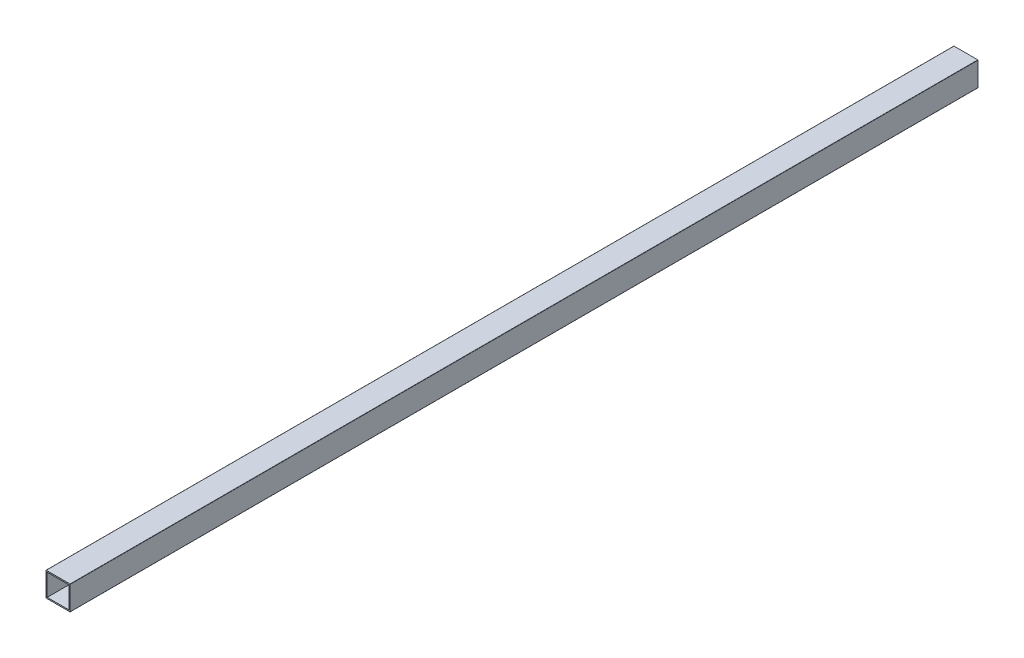
ISO-10303-21;
HEADER;
FILE_DESCRIPTION(('STEP AP214'),'2;1');
FILE_NAME('part.step','',(''),(''),'','','');
FILE_SCHEMA(('AUTOMOTIVE_DESIGN { 1 0 10303 214 1 1 1 1 }'));
ENDSEC;
DATA;
#1=APPLICATION_CONTEXT('core data for automotive mechanical design processes');
#2=APPLICATION_PROTOCOL_DEFINITION('international standard','automotive_design',2000,#1);
#3=PRODUCT_CONTEXT('',#1,'mechanical');
#4=PRODUCT('Part','Part','',(#3));
#5=PRODUCT_RELATED_PRODUCT_CATEGORY('part','',(#4));
#6=PRODUCT_DEFINITION_FORMATION('','',#4);
#7=PRODUCT_DEFINITION_CONTEXT('part definition',#1,'design');
#8=PRODUCT_DEFINITION('design','',#6,#7);
#9=PRODUCT_DEFINITION_SHAPE('','',#8);
#10=(LENGTH_UNIT() NAMED_UNIT(*) SI_UNIT(.MILLI.,.METRE.));
#11=(NAMED_UNIT(*) PLANE_ANGLE_UNIT() SI_UNIT($,.RADIAN.));
#12=(NAMED_UNIT(*) SI_UNIT($,.STERADIAN.) SOLID_ANGLE_UNIT());
#13=UNCERTAINTY_MEASURE_WITH_UNIT(LENGTH_MEASURE(1.E-05),#10,'distance_accuracy_value','');
#14=(GEOMETRIC_REPRESENTATION_CONTEXT(3) GLOBAL_UNCERTAINTY_ASSIGNED_CONTEXT((#13)) GLOBAL_UNIT_ASSIGNED_CONTEXT((#10,
#11,#12)) REPRESENTATION_CONTEXT('',''));
#15=CARTESIAN_POINT('',(0.,0.,0.));
#16=DIRECTION('',(0.,0.,1.));
#17=DIRECTION('',(1.,0.,0.));
#18=AXIS2_PLACEMENT_3D('',#15,#16,#17);
#19=CARTESIAN_POINT('',(0.2,0.2,750.));
#20=DIRECTION('',(0.,0.,-1.));
#21=DIRECTION('',(-1.,0.,0.));
#22=AXIS2_PLACEMENT_3D('',#19,#20,#21);
#23=PLANE('',#22);
#24=CARTESIAN_POINT('',(0.2,0.2,750.));
#25=DIRECTION('',(0.,0.,1.));
#26=DIRECTION('',(-1.,0.,0.));
#27=AXIS2_PLACEMENT_3D('',#24,#25,#26);
#28=CIRCLE('',#27,0.2);
#29=CARTESIAN_POINT('',(0.,0.200000000000001,750.));
#30=VERTEX_POINT('',#29);
#31=CARTESIAN_POINT('',(0.200000000000001,0.,750.));
#32=VERTEX_POINT('',#31);
#33=EDGE_CURVE('E159',#30,#32,#28,.T.);
#34=ORIENTED_EDGE('',*,*,#33,.T.);
#35=DIRECTION('',(1.,0.,0.));
#36=VECTOR('',#35,1.);
#37=CARTESIAN_POINT('',(0.200000000000001,0.,750.));
#38=LINE('',#37,#36);
#39=CARTESIAN_POINT('',(19.8,0.,750.));
#40=VERTEX_POINT('',#39);
#41=EDGE_CURVE('E162',#32,#40,#38,.T.);
#42=ORIENTED_EDGE('',*,*,#41,.T.);
#43=CARTESIAN_POINT('',(19.8,0.2,750.));
#44=DIRECTION('',(0.,0.,1.));
#45=DIRECTION('',(1.,0.,0.));
#46=AXIS2_PLACEMENT_3D('',#43,#44,#45);
#47=CIRCLE('',#46,0.199999999999999);
#48=CARTESIAN_POINT('',(20.,0.2,750.));
#49=VERTEX_POINT('',#48);
#50=EDGE_CURVE('E165',#40,#49,#47,.T.);
#51=ORIENTED_EDGE('',*,*,#50,.T.);
#52=DIRECTION('',(0.,1.,0.));
#53=VECTOR('',#52,1.);
#54=CARTESIAN_POINT('',(20.,0.2,750.));
#55=LINE('',#54,#53);
#56=CARTESIAN_POINT('',(20.,19.8,750.));
#57=VERTEX_POINT('',#56);
#58=EDGE_CURVE('E167',#49,#57,#55,.T.);
#59=ORIENTED_EDGE('',*,*,#58,.T.);
#60=CARTESIAN_POINT('',(19.8,19.8,750.));
#61=DIRECTION('',(0.,0.,1.));
#62=DIRECTION('',(-1.,0.,0.));
#63=AXIS2_PLACEMENT_3D('',#60,#61,#62);
#64=CIRCLE('',#63,0.199999999999997);
#65=CARTESIAN_POINT('',(19.8,20.,750.));
#66=VERTEX_POINT('',#65);
#67=EDGE_CURVE('E169',#57,#66,#64,.T.);
#68=ORIENTED_EDGE('',*,*,#67,.T.);
#69=DIRECTION('',(-1.,0.,0.));
#70=VECTOR('',#69,1.);
#71=CARTESIAN_POINT('',(0.2,20.,750.));
#72=LINE('',#71,#70);
#73=CARTESIAN_POINT('',(0.2,20.,750.));
#74=VERTEX_POINT('',#73);
#75=EDGE_CURVE('E171',#66,#74,#72,.T.);
#76=ORIENTED_EDGE('',*,*,#75,.T.);
#77=CARTESIAN_POINT('',(0.2,19.8,750.));
#78=DIRECTION('',(0.,0.,1.));
#79=DIRECTION('',(-1.,0.,0.));
#80=AXIS2_PLACEMENT_3D('',#77,#78,#79);
#81=CIRCLE('',#80,0.199999999999998);
#82=CARTESIAN_POINT('',(0.,19.8,750.));
#83=VERTEX_POINT('',#82);
#84=EDGE_CURVE('E173',#74,#83,#81,.T.);
#85=ORIENTED_EDGE('',*,*,#84,.T.);
#86=DIRECTION('',(0.,-1.,0.));
#87=VECTOR('',#86,1.);
#88=CARTESIAN_POINT('',(0.,0.200000000000001,750.));
#89=LINE('',#88,#87);
#90=EDGE_CURVE('E175',#83,#30,#89,.T.);
#91=ORIENTED_EDGE('',*,*,#90,.T.);
#92=EDGE_LOOP('',(#34,#42,#51,#59,#68,#76,#85,#91));
#93=FACE_BOUND('',#92,.T.);
#94=DIRECTION('',(0.,-1.,0.));
#95=VECTOR('',#94,1.);
#96=CARTESIAN_POINT('',(1.,1.,750.));
#97=LINE('',#96,#95);
#98=CARTESIAN_POINT('',(1.,19.,750.));
#99=VERTEX_POINT('',#98);
#100=CARTESIAN_POINT('',(1.,1.,750.));
#101=VERTEX_POINT('',#100);
#102=EDGE_CURVE('E123',#99,#101,#97,.T.);
#103=ORIENTED_EDGE('',*,*,#102,.F.);
#104=DIRECTION('',(-1.,0.,0.));
#105=VECTOR('',#104,1.);
#106=CARTESIAN_POINT('',(1.,19.,750.));
#107=LINE('',#106,#105);
#108=CARTESIAN_POINT('',(19.,19.,750.));
#109=VERTEX_POINT('',#108);
#110=EDGE_CURVE('E145',#109,#99,#107,.T.);
#111=ORIENTED_EDGE('',*,*,#110,.F.);
#112=DIRECTION('',(0.,1.,0.));
#113=VECTOR('',#112,1.);
#114=CARTESIAN_POINT('',(19.,1.,750.));
#115=LINE('',#114,#113);
#116=CARTESIAN_POINT('',(19.,1.,750.));
#117=VERTEX_POINT('',#116);
#118=EDGE_CURVE('E143',#117,#109,#115,.T.);
#119=ORIENTED_EDGE('',*,*,#118,.F.);
#120=DIRECTION('',(1.,0.,0.));
#121=VECTOR('',#120,1.);
#122=CARTESIAN_POINT('',(1.,1.,750.));
#123=LINE('',#122,#121);
#124=EDGE_CURVE('E131',#101,#117,#123,.T.);
#125=ORIENTED_EDGE('',*,*,#124,.F.);
#126=EDGE_LOOP('',(#103,#111,#119,#125));
#127=FACE_BOUND('',#126,.T.);
#128=ADVANCED_FACE('F34',(#93,#127),#23,.F.);
#129=CARTESIAN_POINT('',(0.2,0.2,0.));
#130=DIRECTION('',(0.,0.,-1.));
#131=DIRECTION('',(-1.,0.,0.));
#132=AXIS2_PLACEMENT_3D('',#129,#130,#131);
#133=PLANE('',#132);
#134=CARTESIAN_POINT('',(0.2,0.2,0.));
#135=DIRECTION('',(0.,0.,1.));
#136=DIRECTION('',(-1.,0.,0.));
#137=AXIS2_PLACEMENT_3D('',#134,#135,#136);
#138=CIRCLE('',#137,0.2);
#139=CARTESIAN_POINT('',(0.,0.200000000000001,0.));
#140=VERTEX_POINT('',#139);
#141=CARTESIAN_POINT('',(0.200000000000001,0.,0.));
#142=VERTEX_POINT('',#141);
#143=EDGE_CURVE('E139',#140,#142,#138,.T.);
#144=ORIENTED_EDGE('',*,*,#143,.F.);
#145=DIRECTION('',(0.,-1.,0.));
#146=VECTOR('',#145,1.);
#147=CARTESIAN_POINT('',(0.,0.200000000000001,0.));
#148=LINE('',#147,#146);
#149=CARTESIAN_POINT('',(0.,19.8,0.));
#150=VERTEX_POINT('',#149);
#151=EDGE_CURVE('E163',#150,#140,#148,.T.);
#152=ORIENTED_EDGE('',*,*,#151,.F.);
#153=CARTESIAN_POINT('',(0.2,19.8,0.));
#154=DIRECTION('',(0.,0.,1.));
#155=DIRECTION('',(-1.,0.,0.));
#156=AXIS2_PLACEMENT_3D('',#153,#154,#155);
#157=CIRCLE('',#156,0.199999999999998);
#158=CARTESIAN_POINT('',(0.2,20.,0.));
#159=VERTEX_POINT('',#158);
#160=EDGE_CURVE('E190',#159,#150,#157,.T.);
#161=ORIENTED_EDGE('',*,*,#160,.F.);
#162=DIRECTION('',(-1.,0.,0.));
#163=VECTOR('',#162,1.);
#164=CARTESIAN_POINT('',(0.2,20.,0.));
#165=LINE('',#164,#163);
#166=CARTESIAN_POINT('',(19.8,20.,0.));
#167=VERTEX_POINT('',#166);
#168=EDGE_CURVE('E188',#167,#159,#165,.T.);
#169=ORIENTED_EDGE('',*,*,#168,.F.);
#170=CARTESIAN_POINT('',(19.8,19.8,0.));
#171=DIRECTION('',(0.,0.,1.));
#172=DIRECTION('',(-1.,0.,0.));
#173=AXIS2_PLACEMENT_3D('',#170,#171,#172);
#174=CIRCLE('',#173,0.199999999999997);
#175=CARTESIAN_POINT('',(20.,19.8,0.));
#176=VERTEX_POINT('',#175);
#177=EDGE_CURVE('E186',#176,#167,#174,.T.);
#178=ORIENTED_EDGE('',*,*,#177,.F.);
#179=DIRECTION('',(0.,1.,0.));
#180=VECTOR('',#179,1.);
#181=CARTESIAN_POINT('',(20.,0.2,0.));
#182=LINE('',#181,#180);
#183=CARTESIAN_POINT('',(20.,0.2,0.));
#184=VERTEX_POINT('',#183);
#185=EDGE_CURVE('E184',#184,#176,#182,.T.);
#186=ORIENTED_EDGE('',*,*,#185,.F.);
#187=CARTESIAN_POINT('',(19.8,0.2,0.));
#188=DIRECTION('',(0.,0.,1.));
#189=DIRECTION('',(1.,0.,0.));
#190=AXIS2_PLACEMENT_3D('',#187,#188,#189);
#191=CIRCLE('',#190,0.199999999999999);
#192=CARTESIAN_POINT('',(19.8,0.,0.));
#193=VERTEX_POINT('',#192);
#194=EDGE_CURVE('E182',#193,#184,#191,.T.);
#195=ORIENTED_EDGE('',*,*,#194,.F.);
#196=DIRECTION('',(1.,0.,0.));
#197=VECTOR('',#196,1.);
#198=CARTESIAN_POINT('',(0.200000000000001,0.,0.));
#199=LINE('',#198,#197);
#200=EDGE_CURVE('E180',#142,#193,#199,.T.);
#201=ORIENTED_EDGE('',*,*,#200,.F.);
#202=EDGE_LOOP('',(#144,#152,#161,#169,#178,#186,#195,#201));
#203=FACE_BOUND('',#202,.T.);
#204=DIRECTION('',(-1.,0.,0.));
#205=VECTOR('',#204,1.);
#206=CARTESIAN_POINT('',(1.,19.,0.));
#207=LINE('',#206,#205);
#208=CARTESIAN_POINT('',(19.,19.,0.));
#209=VERTEX_POINT('',#208);
#210=CARTESIAN_POINT('',(1.,19.,0.));
#211=VERTEX_POINT('',#210);
#212=EDGE_CURVE('E132',#209,#211,#207,.T.);
#213=ORIENTED_EDGE('',*,*,#212,.T.);
#214=DIRECTION('',(0.,-1.,0.));
#215=VECTOR('',#214,1.);
#216=CARTESIAN_POINT('',(1.,1.,0.));
#217=LINE('',#216,#215);
#218=CARTESIAN_POINT('',(1.,1.,0.));
#219=VERTEX_POINT('',#218);
#220=EDGE_CURVE('E57',#211,#219,#217,.T.);
#221=ORIENTED_EDGE('',*,*,#220,.T.);
#222=DIRECTION('',(1.,0.,0.));
#223=VECTOR('',#222,1.);
#224=CARTESIAN_POINT('',(1.,1.,0.));
#225=LINE('',#224,#223);
#226=CARTESIAN_POINT('',(19.,1.,0.));
#227=VERTEX_POINT('',#226);
#228=EDGE_CURVE('E138',#219,#227,#225,.T.);
#229=ORIENTED_EDGE('',*,*,#228,.T.);
#230=DIRECTION('',(0.,1.,0.));
#231=VECTOR('',#230,1.);
#232=CARTESIAN_POINT('',(19.,1.,0.));
#233=LINE('',#232,#231);
#234=EDGE_CURVE('E151',#227,#209,#233,.T.);
#235=ORIENTED_EDGE('',*,*,#234,.T.);
#236=EDGE_LOOP('',(#213,#221,#229,#235));
#237=FACE_BOUND('',#236,.T.);
#238=ADVANCED_FACE('F220',(#203,#237),#133,.T.);
#239=CARTESIAN_POINT('',(0.2,0.2,750.));
#240=DIRECTION('',(0.,0.,-1.));
#241=DIRECTION('',(-1.,0.,0.));
#242=AXIS2_PLACEMENT_3D('',#239,#240,#241);
#243=CYLINDRICAL_SURFACE('',#242,0.2);
#244=ORIENTED_EDGE('',*,*,#143,.T.);
#245=DIRECTION('',(0.,0.,-1.));
#246=VECTOR('',#245,1.);
#247=CARTESIAN_POINT('',(0.200000000000001,0.,750.));
#248=LINE('',#247,#246);
#249=EDGE_CURVE('E11',#32,#142,#248,.T.);
#250=ORIENTED_EDGE('',*,*,#249,.F.);
#251=ORIENTED_EDGE('',*,*,#33,.F.);
#252=DIRECTION('',(0.,0.,-1.));
#253=VECTOR('',#252,1.);
#254=CARTESIAN_POINT('',(0.,0.200000000000001,750.));
#255=LINE('',#254,#253);
#256=EDGE_CURVE('E177',#30,#140,#255,.T.);
#257=ORIENTED_EDGE('',*,*,#256,.T.);
#258=EDGE_LOOP('',(#244,#250,#251,#257));
#259=FACE_BOUND('',#258,.T.);
#260=ADVANCED_FACE('F36',(#259),#243,.T.);
#261=CARTESIAN_POINT('',(0.200000000000001,0.,750.));
#262=DIRECTION('',(0.,1.,0.));
#263=DIRECTION('',(0.,0.,1.));
#264=AXIS2_PLACEMENT_3D('',#261,#262,#263);
#265=PLANE('',#264);
#266=ORIENTED_EDGE('',*,*,#200,.T.);
#267=DIRECTION('',(0.,0.,-1.));
#268=VECTOR('',#267,1.);
#269=CARTESIAN_POINT('',(19.8,0.,750.));
#270=LINE('',#269,#268);
#271=EDGE_CURVE('E42',#40,#193,#270,.T.);
#272=ORIENTED_EDGE('',*,*,#271,.F.);
#273=ORIENTED_EDGE('',*,*,#41,.F.);
#274=ORIENTED_EDGE('',*,*,#249,.T.);
#275=EDGE_LOOP('',(#266,#272,#273,#274));
#276=FACE_BOUND('',#275,.T.);
#277=ADVANCED_FACE('F237',(#276),#265,.F.);
#278=CARTESIAN_POINT('',(19.8,0.2,750.));
#279=DIRECTION('',(0.,0.,-1.));
#280=DIRECTION('',(-1.,0.,0.));
#281=AXIS2_PLACEMENT_3D('',#278,#279,#280);
#282=CYLINDRICAL_SURFACE('',#281,0.199999999999999);
#283=ORIENTED_EDGE('',*,*,#194,.T.);
#284=DIRECTION('',(0.,0.,-1.));
#285=VECTOR('',#284,1.);
#286=CARTESIAN_POINT('',(20.,0.2,750.));
#287=LINE('',#286,#285);
#288=EDGE_CURVE('E207',#49,#184,#287,.T.);
#289=ORIENTED_EDGE('',*,*,#288,.F.);
#290=ORIENTED_EDGE('',*,*,#50,.F.);
#291=ORIENTED_EDGE('',*,*,#271,.T.);
#292=EDGE_LOOP('',(#283,#289,#290,#291));
#293=FACE_BOUND('',#292,.T.);
#294=ADVANCED_FACE('F214',(#293),#282,.T.);
#295=CARTESIAN_POINT('',(20.,0.2,750.));
#296=DIRECTION('',(-1.,0.,0.));
#297=DIRECTION('',(0.,-1.,0.));
#298=AXIS2_PLACEMENT_3D('',#295,#296,#297);
#299=PLANE('',#298);
#300=ORIENTED_EDGE('',*,*,#185,.T.);
#301=DIRECTION('',(0.,0.,-1.));
#302=VECTOR('',#301,1.);
#303=CARTESIAN_POINT('',(20.,19.8,750.));
#304=LINE('',#303,#302);
#305=EDGE_CURVE('E204',#57,#176,#304,.T.);
#306=ORIENTED_EDGE('',*,*,#305,.F.);
#307=ORIENTED_EDGE('',*,*,#58,.F.);
#308=ORIENTED_EDGE('',*,*,#288,.T.);
#309=EDGE_LOOP('',(#300,#306,#307,#308));
#310=FACE_BOUND('',#309,.T.);
#311=ADVANCED_FACE('F226',(#310),#299,.F.);
#312=CARTESIAN_POINT('',(19.8,19.8,750.));
#313=DIRECTION('',(0.,0.,-1.));
#314=DIRECTION('',(-1.,0.,0.));
#315=AXIS2_PLACEMENT_3D('',#312,#313,#314);
#316=CYLINDRICAL_SURFACE('',#315,0.199999999999997);
#317=ORIENTED_EDGE('',*,*,#177,.T.);
#318=DIRECTION('',(0.,0.,-1.));
#319=VECTOR('',#318,1.);
#320=CARTESIAN_POINT('',(19.8,20.,750.));
#321=LINE('',#320,#319);
#322=EDGE_CURVE('E201',#66,#167,#321,.T.);
#323=ORIENTED_EDGE('',*,*,#322,.F.);
#324=ORIENTED_EDGE('',*,*,#67,.F.);
#325=ORIENTED_EDGE('',*,*,#305,.T.);
#326=EDGE_LOOP('',(#317,#323,#324,#325));
#327=FACE_BOUND('',#326,.T.);
#328=ADVANCED_FACE('F230',(#327),#316,.T.);
#329=CARTESIAN_POINT('',(0.2,20.,750.));
#330=DIRECTION('',(0.,-1.,0.));
#331=DIRECTION('',(0.,0.,-1.));
#332=AXIS2_PLACEMENT_3D('',#329,#330,#331);
#333=PLANE('',#332);
#334=ORIENTED_EDGE('',*,*,#168,.T.);
#335=DIRECTION('',(0.,0.,-1.));
#336=VECTOR('',#335,1.);
#337=CARTESIAN_POINT('',(0.2,20.,750.));
#338=LINE('',#337,#336);
#339=EDGE_CURVE('E198',#74,#159,#338,.T.);
#340=ORIENTED_EDGE('',*,*,#339,.F.);
#341=ORIENTED_EDGE('',*,*,#75,.F.);
#342=ORIENTED_EDGE('',*,*,#322,.T.);
#343=EDGE_LOOP('',(#334,#340,#341,#342));
#344=FACE_BOUND('',#343,.T.);
#345=ADVANCED_FACE('F250',(#344),#333,.F.);
#346=CARTESIAN_POINT('',(0.2,19.8,750.));
#347=DIRECTION('',(0.,0.,-1.));
#348=DIRECTION('',(-1.,0.,0.));
#349=AXIS2_PLACEMENT_3D('',#346,#347,#348);
#350=CYLINDRICAL_SURFACE('',#349,0.199999999999998);
#351=ORIENTED_EDGE('',*,*,#160,.T.);
#352=DIRECTION('',(0.,0.,-1.));
#353=VECTOR('',#352,1.);
#354=CARTESIAN_POINT('',(0.,19.8,750.));
#355=LINE('',#354,#353);
#356=EDGE_CURVE('E195',#83,#150,#355,.T.);
#357=ORIENTED_EDGE('',*,*,#356,.F.);
#358=ORIENTED_EDGE('',*,*,#84,.F.);
#359=ORIENTED_EDGE('',*,*,#339,.T.);
#360=EDGE_LOOP('',(#351,#357,#358,#359));
#361=FACE_BOUND('',#360,.T.);
#362=ADVANCED_FACE('F248',(#361),#350,.T.);
#363=CARTESIAN_POINT('',(0.,0.200000000000001,750.));
#364=DIRECTION('',(1.,0.,0.));
#365=DIRECTION('',(0.,1.,0.));
#366=AXIS2_PLACEMENT_3D('',#363,#364,#365);
#367=PLANE('',#366);
#368=ORIENTED_EDGE('',*,*,#151,.T.);
#369=ORIENTED_EDGE('',*,*,#256,.F.);
#370=ORIENTED_EDGE('',*,*,#90,.F.);
#371=ORIENTED_EDGE('',*,*,#356,.T.);
#372=EDGE_LOOP('',(#368,#369,#370,#371));
#373=FACE_BOUND('',#372,.T.);
#374=ADVANCED_FACE('F243',(#373),#367,.F.);
#375=CARTESIAN_POINT('',(1.,1.,750.));
#376=DIRECTION('',(1.,0.,0.));
#377=DIRECTION('',(0.,0.,-1.));
#378=AXIS2_PLACEMENT_3D('',#375,#376,#377);
#379=PLANE('',#378);
#380=ORIENTED_EDGE('',*,*,#220,.F.);
#381=DIRECTION('',(0.,0.,-1.));
#382=VECTOR('',#381,1.);
#383=CARTESIAN_POINT('',(1.,19.,750.));
#384=LINE('',#383,#382);
#385=EDGE_CURVE('E127',#99,#211,#384,.T.);
#386=ORIENTED_EDGE('',*,*,#385,.F.);
#387=ORIENTED_EDGE('',*,*,#102,.T.);
#388=DIRECTION('',(0.,0.,-1.));
#389=VECTOR('',#388,1.);
#390=CARTESIAN_POINT('',(1.,1.,750.));
#391=LINE('',#390,#389);
#392=EDGE_CURVE('E126',#101,#219,#391,.T.);
#393=ORIENTED_EDGE('',*,*,#392,.T.);
#394=EDGE_LOOP('',(#380,#386,#387,#393));
#395=FACE_BOUND('',#394,.T.);
#396=ADVANCED_FACE('F125',(#395),#379,.T.);
#397=CARTESIAN_POINT('',(1.,1.,750.));
#398=DIRECTION('',(0.,1.,0.));
#399=DIRECTION('',(0.,0.,1.));
#400=AXIS2_PLACEMENT_3D('',#397,#398,#399);
#401=PLANE('',#400);
#402=ORIENTED_EDGE('',*,*,#228,.F.);
#403=ORIENTED_EDGE('',*,*,#392,.F.);
#404=ORIENTED_EDGE('',*,*,#124,.T.);
#405=DIRECTION('',(0.,0.,-1.));
#406=VECTOR('',#405,1.);
#407=CARTESIAN_POINT('',(19.,1.,750.));
#408=LINE('',#407,#406);
#409=EDGE_CURVE('E140',#117,#227,#408,.T.);
#410=ORIENTED_EDGE('',*,*,#409,.T.);
#411=EDGE_LOOP('',(#402,#403,#404,#410));
#412=FACE_BOUND('',#411,.T.);
#413=ADVANCED_FACE('F135',(#412),#401,.T.);
#414=CARTESIAN_POINT('',(19.,1.,750.));
#415=DIRECTION('',(-1.,0.,0.));
#416=DIRECTION('',(0.,-1.,0.));
#417=AXIS2_PLACEMENT_3D('',#414,#415,#416);
#418=PLANE('',#417);
#419=ORIENTED_EDGE('',*,*,#234,.F.);
#420=ORIENTED_EDGE('',*,*,#409,.F.);
#421=ORIENTED_EDGE('',*,*,#118,.T.);
#422=DIRECTION('',(0.,0.,-1.));
#423=VECTOR('',#422,1.);
#424=CARTESIAN_POINT('',(19.,19.,750.));
#425=LINE('',#424,#423);
#426=EDGE_CURVE('E49',#109,#209,#425,.T.);
#427=ORIENTED_EDGE('',*,*,#426,.T.);
#428=EDGE_LOOP('',(#419,#420,#421,#427));
#429=FACE_BOUND('',#428,.T.);
#430=ADVANCED_FACE('F275',(#429),#418,.T.);
#431=CARTESIAN_POINT('',(1.,19.,750.));
#432=DIRECTION('',(0.,-1.,0.));
#433=DIRECTION('',(0.,0.,-1.));
#434=AXIS2_PLACEMENT_3D('',#431,#432,#433);
#435=PLANE('',#434);
#436=ORIENTED_EDGE('',*,*,#212,.F.);
#437=ORIENTED_EDGE('',*,*,#426,.F.);
#438=ORIENTED_EDGE('',*,*,#110,.T.);
#439=ORIENTED_EDGE('',*,*,#385,.T.);
#440=EDGE_LOOP('',(#436,#437,#438,#439));
#441=FACE_BOUND('',#440,.T.);
#442=ADVANCED_FACE('F279',(#441),#435,.T.);
#443=CLOSED_SHELL('',(#128,#238,#260,#277,#294,#311,#328,#345,#362,#374,#396,#413,#430,#442));
#444=MANIFOLD_SOLID_BREP('B2',#443);
#445=ADVANCED_BREP_SHAPE_REPRESENTATION('',(#18,#444),#14);
#446=SHAPE_DEFINITION_REPRESENTATION(#9,#445);
ENDSEC;
END-ISO-10303-21;
